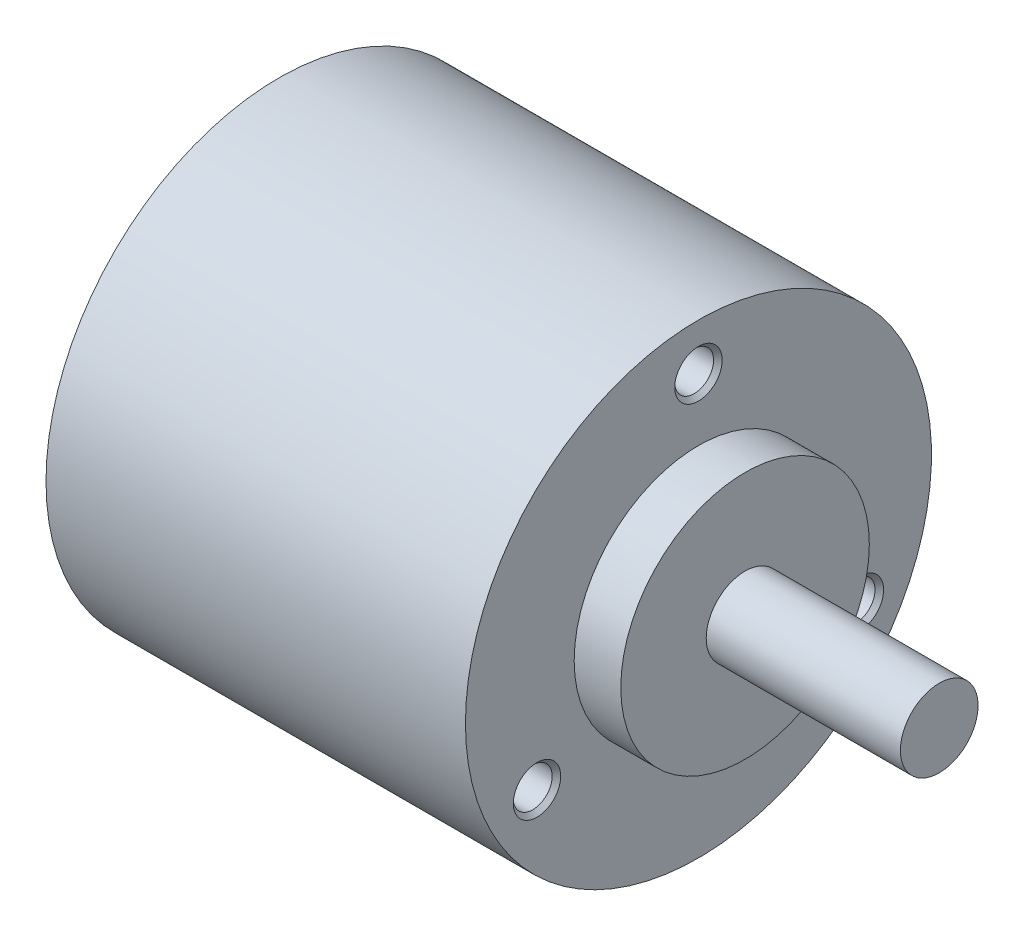
ISO-10303-21;
HEADER;
FILE_DESCRIPTION(('STEP AP214'),'2;1');
FILE_NAME('part.step','',(''),(''),'','','');
FILE_SCHEMA(('AUTOMOTIVE_DESIGN { 1 0 10303 214 1 1 1 1 }'));
ENDSEC;
DATA;
#1=APPLICATION_CONTEXT('core data for automotive mechanical design processes');
#2=APPLICATION_PROTOCOL_DEFINITION('international standard','automotive_design',2000,#1);
#3=PRODUCT_CONTEXT('',#1,'mechanical');
#4=PRODUCT('Part','Part','',(#3));
#5=PRODUCT_RELATED_PRODUCT_CATEGORY('part','',(#4));
#6=PRODUCT_DEFINITION_FORMATION('','',#4);
#7=PRODUCT_DEFINITION_CONTEXT('part definition',#1,'design');
#8=PRODUCT_DEFINITION('design','',#6,#7);
#9=PRODUCT_DEFINITION_SHAPE('','',#8);
#10=(LENGTH_UNIT() NAMED_UNIT(*) SI_UNIT(.MILLI.,.METRE.));
#11=(NAMED_UNIT(*) PLANE_ANGLE_UNIT() SI_UNIT($,.RADIAN.));
#12=(NAMED_UNIT(*) SI_UNIT($,.STERADIAN.) SOLID_ANGLE_UNIT());
#13=UNCERTAINTY_MEASURE_WITH_UNIT(LENGTH_MEASURE(1.E-05),#10,'distance_accuracy_value','');
#14=(GEOMETRIC_REPRESENTATION_CONTEXT(3) GLOBAL_UNCERTAINTY_ASSIGNED_CONTEXT((#13)) GLOBAL_UNIT_ASSIGNED_CONTEXT((#10,
#11,#12)) REPRESENTATION_CONTEXT('',''));
#15=CARTESIAN_POINT('',(0.,0.,0.));
#16=DIRECTION('',(0.,0.,1.));
#17=DIRECTION('',(1.,0.,0.));
#18=AXIS2_PLACEMENT_3D('',#15,#16,#17);
#19=CARTESIAN_POINT('',(-51.1550534739916,0.,0.));
#20=DIRECTION('',(-1.,0.,0.));
#21=DIRECTION('',(0.,0.,1.));
#22=AXIS2_PLACEMENT_3D('',#19,#20,#21);
#23=CYLINDRICAL_SURFACE('',#22,2.5);
#24=CARTESIAN_POINT('',(3.,0.,0.));
#25=DIRECTION('',(-1.,0.,0.));
#26=DIRECTION('',(0.,0.,1.));
#27=AXIS2_PLACEMENT_3D('',#24,#25,#26);
#28=CIRCLE('',#27,2.5);
#29=CARTESIAN_POINT('',(3.,0.,2.5));
#30=VERTEX_POINT('',#29);
#31=EDGE_CURVE('E89',#30,#30,#28,.T.);
#32=ORIENTED_EDGE('',*,*,#31,.F.);
#33=EDGE_LOOP('',(#32));
#34=FACE_BOUND('',#33,.T.);
#35=CARTESIAN_POINT('',(15.5,0.,0.));
#36=DIRECTION('',(-1.,0.,0.));
#37=DIRECTION('',(0.,0.,1.));
#38=AXIS2_PLACEMENT_3D('',#35,#36,#37);
#39=CIRCLE('',#38,2.5);
#40=CARTESIAN_POINT('',(15.5,0.,2.5));
#41=VERTEX_POINT('',#40);
#42=EDGE_CURVE('E11',#41,#41,#39,.T.);
#43=ORIENTED_EDGE('',*,*,#42,.T.);
#44=EDGE_LOOP('',(#43));
#45=FACE_BOUND('',#44,.T.);
#46=ADVANCED_FACE('F37',(#34,#45),#23,.T.);
#47=CARTESIAN_POINT('',(15.5,2.5,0.));
#48=DIRECTION('',(-1.,0.,0.));
#49=DIRECTION('',(0.,0.,1.));
#50=AXIS2_PLACEMENT_3D('',#47,#48,#49);
#51=PLANE('',#50);
#52=ORIENTED_EDGE('',*,*,#42,.F.);
#53=EDGE_LOOP('',(#52));
#54=FACE_BOUND('',#53,.T.);
#55=ADVANCED_FACE('F133',(#54),#51,.F.);
#56=CARTESIAN_POINT('',(-27.,0.,0.));
#57=DIRECTION('',(1.,0.,0.));
#58=DIRECTION('',(0.,0.,-1.));
#59=AXIS2_PLACEMENT_3D('',#56,#57,#58);
#60=PLANE('',#59);
#61=CARTESIAN_POINT('',(-27.,0.,0.));
#62=DIRECTION('',(-1.,0.,0.));
#63=DIRECTION('',(0.,0.,1.));
#64=AXIS2_PLACEMENT_3D('',#61,#62,#63);
#65=CIRCLE('',#64,15.);
#66=CARTESIAN_POINT('',(-27.,0.,15.));
#67=VERTEX_POINT('',#66);
#68=EDGE_CURVE('E44',#67,#67,#65,.T.);
#69=ORIENTED_EDGE('',*,*,#68,.T.);
#70=EDGE_LOOP('',(#69));
#71=FACE_BOUND('',#70,.T.);
#72=ADVANCED_FACE('F103',(#71),#60,.F.);
#73=CARTESIAN_POINT('',(-51.1550534739916,0.,0.));
#74=DIRECTION('',(-1.,0.,0.));
#75=DIRECTION('',(0.,0.,1.));
#76=AXIS2_PLACEMENT_3D('',#73,#74,#75);
#77=CYLINDRICAL_SURFACE('',#76,15.);
#78=ORIENTED_EDGE('',*,*,#68,.F.);
#79=EDGE_LOOP('',(#78));
#80=FACE_BOUND('',#79,.T.);
#81=CARTESIAN_POINT('',(0.,0.,0.));
#82=DIRECTION('',(-1.,0.,0.));
#83=DIRECTION('',(0.,0.,1.));
#84=AXIS2_PLACEMENT_3D('',#81,#82,#83);
#85=CIRCLE('',#84,15.);
#86=CARTESIAN_POINT('',(0.,0.,15.));
#87=VERTEX_POINT('',#86);
#88=EDGE_CURVE('E98',#87,#87,#85,.T.);
#89=ORIENTED_EDGE('',*,*,#88,.T.);
#90=EDGE_LOOP('',(#89));
#91=FACE_BOUND('',#90,.T.);
#92=ADVANCED_FACE('F105',(#80,#91),#77,.T.);
#93=CARTESIAN_POINT('',(0.,15.,0.));
#94=DIRECTION('',(-1.,0.,0.));
#95=DIRECTION('',(0.,0.,1.));
#96=AXIS2_PLACEMENT_3D('',#93,#94,#95);
#97=PLANE('',#96);
#98=CARTESIAN_POINT('',(0.,12.,0.));
#99=DIRECTION('',(1.,0.,0.));
#100=DIRECTION('',(0.,0.,-1.));
#101=AXIS2_PLACEMENT_3D('',#98,#99,#100);
#102=CIRCLE('',#101,1.525);
#103=CARTESIAN_POINT('',(0.,12.,-1.525));
#104=VERTEX_POINT('',#103);
#105=EDGE_CURVE('E71',#104,#104,#102,.T.);
#106=ORIENTED_EDGE('',*,*,#105,.F.);
#107=EDGE_LOOP('',(#106));
#108=FACE_BOUND('',#107,.T.);
#109=CARTESIAN_POINT('',(0.,-6.00000000000005,10.3923048454132));
#110=DIRECTION('',(1.,0.,0.));
#111=DIRECTION('',(0.,0.,-1.));
#112=AXIS2_PLACEMENT_3D('',#109,#110,#111);
#113=CIRCLE('',#112,1.525);
#114=CARTESIAN_POINT('',(0.,-6.00000000000005,8.86730484541324));
#115=VERTEX_POINT('',#114);
#116=EDGE_CURVE('E64',#115,#115,#113,.T.);
#117=ORIENTED_EDGE('',*,*,#116,.F.);
#118=EDGE_LOOP('',(#117));
#119=FACE_BOUND('',#118,.T.);
#120=CARTESIAN_POINT('',(0.,-6.00000000000005,-10.3923048454132));
#121=DIRECTION('',(1.,0.,0.));
#122=DIRECTION('',(0.,0.,-1.));
#123=AXIS2_PLACEMENT_3D('',#120,#121,#122);
#124=CIRCLE('',#123,1.525);
#125=CARTESIAN_POINT('',(0.,-6.00000000000005,-11.9173048454132));
#126=VERTEX_POINT('',#125);
#127=EDGE_CURVE('E80',#126,#126,#124,.T.);
#128=ORIENTED_EDGE('',*,*,#127,.F.);
#129=EDGE_LOOP('',(#128));
#130=FACE_BOUND('',#129,.T.);
#131=ORIENTED_EDGE('',*,*,#88,.F.);
#132=EDGE_LOOP('',(#131));
#133=FACE_BOUND('',#132,.T.);
#134=CARTESIAN_POINT('',(0.,0.,0.));
#135=DIRECTION('',(-1.,0.,0.));
#136=DIRECTION('',(0.,0.,1.));
#137=AXIS2_PLACEMENT_3D('',#134,#135,#136);
#138=CIRCLE('',#137,8.);
#139=CARTESIAN_POINT('',(0.,0.,8.));
#140=VERTEX_POINT('',#139);
#141=EDGE_CURVE('E95',#140,#140,#138,.T.);
#142=ORIENTED_EDGE('',*,*,#141,.T.);
#143=EDGE_LOOP('',(#142));
#144=FACE_BOUND('',#143,.T.);
#145=ADVANCED_FACE('F108',(#108,#119,#130,#133,#144),#97,.F.);
#146=CARTESIAN_POINT('',(-51.1550534739916,0.,0.));
#147=DIRECTION('',(-1.,0.,0.));
#148=DIRECTION('',(0.,0.,1.));
#149=AXIS2_PLACEMENT_3D('',#146,#147,#148);
#150=CYLINDRICAL_SURFACE('',#149,8.);
#151=ORIENTED_EDGE('',*,*,#141,.F.);
#152=EDGE_LOOP('',(#151));
#153=FACE_BOUND('',#152,.T.);
#154=CARTESIAN_POINT('',(3.,0.,0.));
#155=DIRECTION('',(-1.,0.,0.));
#156=DIRECTION('',(0.,0.,1.));
#157=AXIS2_PLACEMENT_3D('',#154,#155,#156);
#158=CIRCLE('',#157,8.);
#159=CARTESIAN_POINT('',(3.,0.,8.));
#160=VERTEX_POINT('',#159);
#161=EDGE_CURVE('E92',#160,#160,#158,.T.);
#162=ORIENTED_EDGE('',*,*,#161,.T.);
#163=EDGE_LOOP('',(#162));
#164=FACE_BOUND('',#163,.T.);
#165=ADVANCED_FACE('F114',(#153,#164),#150,.T.);
#166=CARTESIAN_POINT('',(3.,8.,0.));
#167=DIRECTION('',(-1.,0.,0.));
#168=DIRECTION('',(0.,0.,1.));
#169=AXIS2_PLACEMENT_3D('',#166,#167,#168);
#170=PLANE('',#169);
#171=ORIENTED_EDGE('',*,*,#161,.F.);
#172=EDGE_LOOP('',(#171));
#173=FACE_BOUND('',#172,.T.);
#174=ORIENTED_EDGE('',*,*,#31,.T.);
#175=EDGE_LOOP('',(#174));
#176=FACE_BOUND('',#175,.T.);
#177=ADVANCED_FACE('F121',(#173,#176),#170,.F.);
#178=CARTESIAN_POINT('',(-8.5,-6.00000000000005,-10.3923048454132));
#179=DIRECTION('',(1.,0.,0.));
#180=DIRECTION('',(0.,0.,-1.));
#181=AXIS2_PLACEMENT_3D('',#178,#179,#180);
#182=CONICAL_SURFACE('',#181,1.25,1.02974425867665);
#183=CARTESIAN_POINT('',(-9.25107577378445,-6.00000000000005,-10.3923048454132));
#184=VERTEX_POINT('',#183);
#185=VERTEX_LOOP('',#184);
#186=FACE_BOUND('',#185,.T.);
#187=CARTESIAN_POINT('',(-8.5,-6.00000000000005,-10.3923048454132));
#188=DIRECTION('',(1.,0.,0.));
#189=DIRECTION('',(0.,0.,-1.));
#190=AXIS2_PLACEMENT_3D('',#187,#188,#189);
#191=CIRCLE('',#190,1.25);
#192=CARTESIAN_POINT('',(-8.5,-6.00000000000005,-11.6423048454132));
#193=VERTEX_POINT('',#192);
#194=EDGE_CURVE('E86',#193,#193,#191,.T.);
#195=ORIENTED_EDGE('',*,*,#194,.T.);
#196=EDGE_LOOP('',(#195));
#197=FACE_BOUND('',#196,.T.);
#198=ADVANCED_FACE('F127',(#186,#197),#182,.F.);
#199=CARTESIAN_POINT('',(0.,-6.00000000000005,-10.3923048454132));
#200=DIRECTION('',(1.,0.,0.));
#201=DIRECTION('',(0.,0.,-1.));
#202=AXIS2_PLACEMENT_3D('',#199,#200,#201);
#203=CYLINDRICAL_SURFACE('',#202,1.25);
#204=ORIENTED_EDGE('',*,*,#194,.F.);
#205=EDGE_LOOP('',(#204));
#206=FACE_BOUND('',#205,.T.);
#207=CARTESIAN_POINT('',(-0.275000000000001,-6.00000000000005,-10.3923048454132));
#208=DIRECTION('',(1.,0.,0.));
#209=DIRECTION('',(0.,0.,-1.));
#210=AXIS2_PLACEMENT_3D('',#207,#208,#209);
#211=CIRCLE('',#210,1.25);
#212=CARTESIAN_POINT('',(-0.275000000000001,-6.00000000000005,-11.6423048454132));
#213=VERTEX_POINT('',#212);
#214=EDGE_CURVE('E83',#213,#213,#211,.T.);
#215=ORIENTED_EDGE('',*,*,#214,.T.);
#216=EDGE_LOOP('',(#215));
#217=FACE_BOUND('',#216,.T.);
#218=ADVANCED_FACE('F144',(#206,#217),#203,.F.);
#219=CARTESIAN_POINT('',(0.,-6.00000000000005,-10.3923048454132));
#220=DIRECTION('',(1.,0.,0.));
#221=DIRECTION('',(0.,0.,-1.));
#222=AXIS2_PLACEMENT_3D('',#219,#220,#221);
#223=CONICAL_SURFACE('',#222,1.525,0.785398163397448);
#224=ORIENTED_EDGE('',*,*,#214,.F.);
#225=EDGE_LOOP('',(#224));
#226=FACE_BOUND('',#225,.T.);
#227=ORIENTED_EDGE('',*,*,#127,.T.);
#228=EDGE_LOOP('',(#227));
#229=FACE_BOUND('',#228,.T.);
#230=ADVANCED_FACE('F147',(#226,#229),#223,.F.);
#231=CARTESIAN_POINT('',(-8.5,-6.00000000000005,10.3923048454132));
#232=DIRECTION('',(1.,0.,0.));
#233=DIRECTION('',(0.,0.,-1.));
#234=AXIS2_PLACEMENT_3D('',#231,#232,#233);
#235=CONICAL_SURFACE('',#234,1.25,1.02974425867665);
#236=CARTESIAN_POINT('',(-9.25107577378445,-6.00000000000005,10.3923048454132));
#237=VERTEX_POINT('',#236);
#238=VERTEX_LOOP('',#237);
#239=FACE_BOUND('',#238,.T.);
#240=CARTESIAN_POINT('',(-8.5,-6.00000000000005,10.3923048454132));
#241=DIRECTION('',(1.,0.,0.));
#242=DIRECTION('',(0.,0.,-1.));
#243=AXIS2_PLACEMENT_3D('',#240,#241,#242);
#244=CIRCLE('',#243,1.25);
#245=CARTESIAN_POINT('',(-8.5,-6.00000000000005,9.14230484541324));
#246=VERTEX_POINT('',#245);
#247=EDGE_CURVE('E77',#246,#246,#244,.T.);
#248=ORIENTED_EDGE('',*,*,#247,.T.);
#249=EDGE_LOOP('',(#248));
#250=FACE_BOUND('',#249,.T.);
#251=ADVANCED_FACE('F151',(#239,#250),#235,.F.);
#252=CARTESIAN_POINT('',(0.,-6.00000000000005,10.3923048454132));
#253=DIRECTION('',(1.,0.,0.));
#254=DIRECTION('',(0.,0.,-1.));
#255=AXIS2_PLACEMENT_3D('',#252,#253,#254);
#256=CYLINDRICAL_SURFACE('',#255,1.25);
#257=ORIENTED_EDGE('',*,*,#247,.F.);
#258=EDGE_LOOP('',(#257));
#259=FACE_BOUND('',#258,.T.);
#260=CARTESIAN_POINT('',(-0.275000000000001,-6.00000000000005,10.3923048454132));
#261=DIRECTION('',(1.,0.,0.));
#262=DIRECTION('',(0.,0.,-1.));
#263=AXIS2_PLACEMENT_3D('',#260,#261,#262);
#264=CIRCLE('',#263,1.25);
#265=CARTESIAN_POINT('',(-0.275000000000001,-6.00000000000005,9.14230484541324));
#266=VERTEX_POINT('',#265);
#267=EDGE_CURVE('E68',#266,#266,#264,.T.);
#268=ORIENTED_EDGE('',*,*,#267,.T.);
#269=EDGE_LOOP('',(#268));
#270=FACE_BOUND('',#269,.T.);
#271=ADVANCED_FACE('F155',(#259,#270),#256,.F.);
#272=CARTESIAN_POINT('',(0.,-6.00000000000005,10.3923048454132));
#273=DIRECTION('',(1.,0.,0.));
#274=DIRECTION('',(0.,0.,-1.));
#275=AXIS2_PLACEMENT_3D('',#272,#273,#274);
#276=CONICAL_SURFACE('',#275,1.525,0.785398163397448);
#277=ORIENTED_EDGE('',*,*,#267,.F.);
#278=EDGE_LOOP('',(#277));
#279=FACE_BOUND('',#278,.T.);
#280=ORIENTED_EDGE('',*,*,#116,.T.);
#281=EDGE_LOOP('',(#280));
#282=FACE_BOUND('',#281,.T.);
#283=ADVANCED_FACE('F58',(#279,#282),#276,.F.);
#284=CARTESIAN_POINT('',(-8.5,12.,0.));
#285=DIRECTION('',(1.,0.,0.));
#286=DIRECTION('',(0.,0.,-1.));
#287=AXIS2_PLACEMENT_3D('',#284,#285,#286);
#288=CONICAL_SURFACE('',#287,1.25,1.02974425867665);
#289=CARTESIAN_POINT('',(-9.25107577378445,12.,0.));
#290=VERTEX_POINT('',#289);
#291=VERTEX_LOOP('',#290);
#292=FACE_BOUND('',#291,.T.);
#293=CARTESIAN_POINT('',(-8.5,12.,0.));
#294=DIRECTION('',(1.,0.,0.));
#295=DIRECTION('',(0.,0.,-1.));
#296=AXIS2_PLACEMENT_3D('',#293,#294,#295);
#297=CIRCLE('',#296,1.25);
#298=CARTESIAN_POINT('',(-8.5,12.,-1.25));
#299=VERTEX_POINT('',#298);
#300=EDGE_CURVE('E62',#299,#299,#297,.T.);
#301=ORIENTED_EDGE('',*,*,#300,.T.);
#302=EDGE_LOOP('',(#301));
#303=FACE_BOUND('',#302,.T.);
#304=ADVANCED_FACE('F54',(#292,#303),#288,.F.);
#305=CARTESIAN_POINT('',(0.,12.,0.));
#306=DIRECTION('',(1.,0.,0.));
#307=DIRECTION('',(0.,0.,-1.));
#308=AXIS2_PLACEMENT_3D('',#305,#306,#307);
#309=CYLINDRICAL_SURFACE('',#308,1.25);
#310=ORIENTED_EDGE('',*,*,#300,.F.);
#311=EDGE_LOOP('',(#310));
#312=FACE_BOUND('',#311,.T.);
#313=CARTESIAN_POINT('',(-0.275000000000001,12.,0.));
#314=DIRECTION('',(1.,0.,0.));
#315=DIRECTION('',(0.,0.,-1.));
#316=AXIS2_PLACEMENT_3D('',#313,#314,#315);
#317=CIRCLE('',#316,1.25);
#318=CARTESIAN_POINT('',(-0.275000000000001,12.,-1.25));
#319=VERTEX_POINT('',#318);
#320=EDGE_CURVE('E65',#319,#319,#317,.T.);
#321=ORIENTED_EDGE('',*,*,#320,.T.);
#322=EDGE_LOOP('',(#321));
#323=FACE_BOUND('',#322,.T.);
#324=ADVANCED_FACE('F57',(#312,#323),#309,.F.);
#325=CARTESIAN_POINT('',(0.,12.,0.));
#326=DIRECTION('',(1.,0.,0.));
#327=DIRECTION('',(0.,0.,-1.));
#328=AXIS2_PLACEMENT_3D('',#325,#326,#327);
#329=CONICAL_SURFACE('',#328,1.525,0.785398163397448);
#330=ORIENTED_EDGE('',*,*,#320,.F.);
#331=EDGE_LOOP('',(#330));
#332=FACE_BOUND('',#331,.T.);
#333=ORIENTED_EDGE('',*,*,#105,.T.);
#334=EDGE_LOOP('',(#333));
#335=FACE_BOUND('',#334,.T.);
#336=ADVANCED_FACE('F164',(#332,#335),#329,.F.);
#337=CLOSED_SHELL('',(#46,#55,#72,#92,#145,#165,#177,#198,#218,#230,#251,#271,#283,#304,#324,#336));
#338=MANIFOLD_SOLID_BREP('B2',#337);
#339=ADVANCED_BREP_SHAPE_REPRESENTATION('',(#18,#338),#14);
#340=SHAPE_DEFINITION_REPRESENTATION(#9,#339);
ENDSEC;
END-ISO-10303-21;
